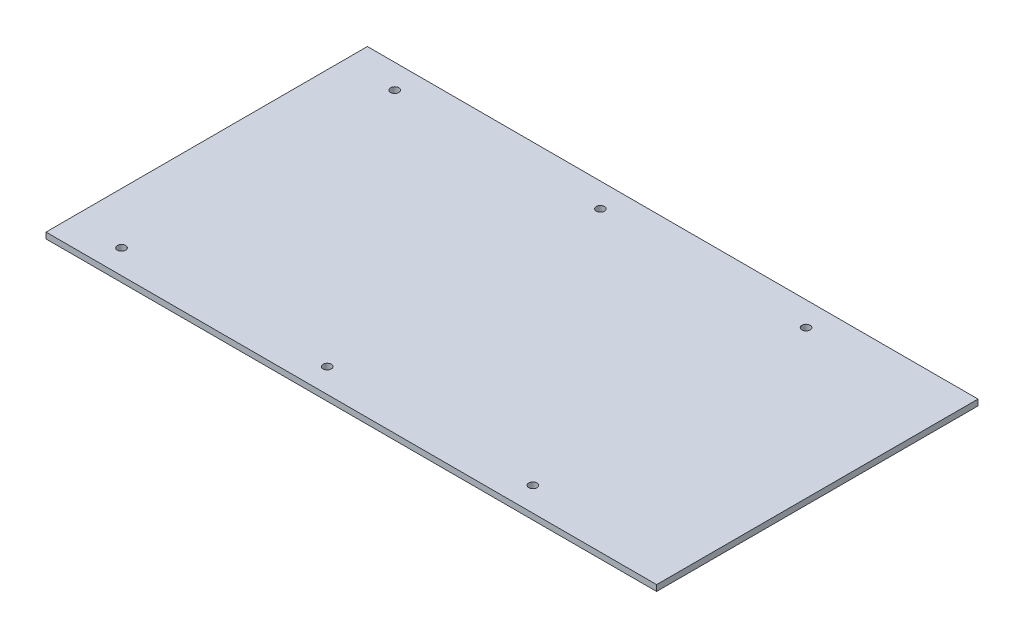
ISO-10303-21;
HEADER;
FILE_DESCRIPTION(('STEP AP214'),'2;1');
FILE_NAME('part.step','',(''),(''),'','','');
FILE_SCHEMA(('AUTOMOTIVE_DESIGN { 1 0 10303 214 1 1 1 1 }'));
ENDSEC;
DATA;
#1=APPLICATION_CONTEXT('core data for automotive mechanical design processes');
#2=APPLICATION_PROTOCOL_DEFINITION('international standard','automotive_design',2000,#1);
#3=PRODUCT_CONTEXT('',#1,'mechanical');
#4=PRODUCT('Part','Part','',(#3));
#5=PRODUCT_RELATED_PRODUCT_CATEGORY('part','',(#4));
#6=PRODUCT_DEFINITION_FORMATION('','',#4);
#7=PRODUCT_DEFINITION_CONTEXT('part definition',#1,'design');
#8=PRODUCT_DEFINITION('design','',#6,#7);
#9=PRODUCT_DEFINITION_SHAPE('','',#8);
#10=(LENGTH_UNIT() NAMED_UNIT(*) SI_UNIT(.MILLI.,.METRE.));
#11=(NAMED_UNIT(*) PLANE_ANGLE_UNIT() SI_UNIT($,.RADIAN.));
#12=(NAMED_UNIT(*) SI_UNIT($,.STERADIAN.) SOLID_ANGLE_UNIT());
#13=UNCERTAINTY_MEASURE_WITH_UNIT(LENGTH_MEASURE(1.E-05),#10,'distance_accuracy_value','');
#14=(GEOMETRIC_REPRESENTATION_CONTEXT(3) GLOBAL_UNCERTAINTY_ASSIGNED_CONTEXT((#13)) GLOBAL_UNIT_ASSIGNED_CONTEXT((#10,
#11,#12)) REPRESENTATION_CONTEXT('',''));
#15=CARTESIAN_POINT('',(0.,0.,0.));
#16=DIRECTION('',(0.,0.,1.));
#17=DIRECTION('',(1.,0.,0.));
#18=AXIS2_PLACEMENT_3D('',#15,#16,#17);
#19=CARTESIAN_POINT('',(-101.6,2.3622,-63.5));
#20=DIRECTION('',(1.,0.,0.));
#21=DIRECTION('',(0.,0.,-1.));
#22=AXIS2_PLACEMENT_3D('',#19,#20,#21);
#23=PLANE('',#22);
#24=DIRECTION('',(0.,0.,1.));
#25=VECTOR('',#24,1.);
#26=CARTESIAN_POINT('',(-101.6,0.,-63.5));
#27=LINE('',#26,#25);
#28=CARTESIAN_POINT('',(-101.6,0.,-63.5));
#29=VERTEX_POINT('',#28);
#30=CARTESIAN_POINT('',(-101.6,0.,63.5));
#31=VERTEX_POINT('',#30);
#32=EDGE_CURVE('E84',#29,#31,#27,.T.);
#33=ORIENTED_EDGE('',*,*,#32,.T.);
#34=DIRECTION('',(0.,-1.,0.));
#35=VECTOR('',#34,1.);
#36=CARTESIAN_POINT('',(-101.6,2.3622,63.5));
#37=LINE('',#36,#35);
#38=CARTESIAN_POINT('',(-101.6,2.3622,63.5));
#39=VERTEX_POINT('',#38);
#40=EDGE_CURVE('E11',#39,#31,#37,.T.);
#41=ORIENTED_EDGE('',*,*,#40,.F.);
#42=DIRECTION('',(0.,0.,1.));
#43=VECTOR('',#42,1.);
#44=CARTESIAN_POINT('',(-101.6,2.3622,-63.5));
#45=LINE('',#44,#43);
#46=CARTESIAN_POINT('',(-101.6,2.3622,-63.5));
#47=VERTEX_POINT('',#46);
#48=EDGE_CURVE('E127',#47,#39,#45,.T.);
#49=ORIENTED_EDGE('',*,*,#48,.F.);
#50=DIRECTION('',(0.,-1.,0.));
#51=VECTOR('',#50,1.);
#52=CARTESIAN_POINT('',(-101.6,2.3622,-63.5));
#53=LINE('',#52,#51);
#54=EDGE_CURVE('E42',#47,#29,#53,.T.);
#55=ORIENTED_EDGE('',*,*,#54,.T.);
#56=EDGE_LOOP('',(#33,#41,#49,#55));
#57=FACE_BOUND('',#56,.T.);
#58=ADVANCED_FACE('F34',(#57),#23,.F.);
#59=CARTESIAN_POINT('',(-101.6,2.3622,63.5));
#60=DIRECTION('',(0.,0.,-1.));
#61=DIRECTION('',(-1.,0.,0.));
#62=AXIS2_PLACEMENT_3D('',#59,#60,#61);
#63=PLANE('',#62);
#64=DIRECTION('',(1.,0.,0.));
#65=VECTOR('',#64,1.);
#66=CARTESIAN_POINT('',(-101.6,0.,63.5));
#67=LINE('',#66,#65);
#68=CARTESIAN_POINT('',(139.7,0.,63.5));
#69=VERTEX_POINT('',#68);
#70=EDGE_CURVE('E73',#31,#69,#67,.T.);
#71=ORIENTED_EDGE('',*,*,#70,.T.);
#72=DIRECTION('',(0.,-1.,0.));
#73=VECTOR('',#72,1.);
#74=CARTESIAN_POINT('',(139.7,2.3622,63.5));
#75=LINE('',#74,#73);
#76=CARTESIAN_POINT('',(139.7,2.3622,63.5));
#77=VERTEX_POINT('',#76);
#78=EDGE_CURVE('E76',#77,#69,#75,.T.);
#79=ORIENTED_EDGE('',*,*,#78,.F.);
#80=DIRECTION('',(1.,0.,0.));
#81=VECTOR('',#80,1.);
#82=CARTESIAN_POINT('',(-101.6,2.3622,63.5));
#83=LINE('',#82,#81);
#84=EDGE_CURVE('E57',#39,#77,#83,.T.);
#85=ORIENTED_EDGE('',*,*,#84,.F.);
#86=ORIENTED_EDGE('',*,*,#40,.T.);
#87=EDGE_LOOP('',(#71,#79,#85,#86));
#88=FACE_BOUND('',#87,.T.);
#89=ADVANCED_FACE('F75',(#88),#63,.F.);
#90=CARTESIAN_POINT('',(-101.6,2.3622,-63.5));
#91=DIRECTION('',(0.,0.,1.));
#92=DIRECTION('',(1.,0.,0.));
#93=AXIS2_PLACEMENT_3D('',#90,#91,#92);
#94=PLANE('',#93);
#95=DIRECTION('',(-1.,0.,0.));
#96=VECTOR('',#95,1.);
#97=CARTESIAN_POINT('',(-101.6,0.,-63.5));
#98=LINE('',#97,#96);
#99=CARTESIAN_POINT('',(139.7,0.,-63.5));
#100=VERTEX_POINT('',#99);
#101=EDGE_CURVE('E83',#100,#29,#98,.T.);
#102=ORIENTED_EDGE('',*,*,#101,.T.);
#103=ORIENTED_EDGE('',*,*,#54,.F.);
#104=DIRECTION('',(-1.,0.,0.));
#105=VECTOR('',#104,1.);
#106=CARTESIAN_POINT('',(-101.6,2.3622,-63.5));
#107=LINE('',#106,#105);
#108=CARTESIAN_POINT('',(139.7,2.3622,-63.5));
#109=VERTEX_POINT('',#108);
#110=EDGE_CURVE('E50',#109,#47,#107,.T.);
#111=ORIENTED_EDGE('',*,*,#110,.F.);
#112=DIRECTION('',(0.,-1.,0.));
#113=VECTOR('',#112,1.);
#114=CARTESIAN_POINT('',(139.7,2.3622,-63.5));
#115=LINE('',#114,#113);
#116=EDGE_CURVE('E94',#109,#100,#115,.T.);
#117=ORIENTED_EDGE('',*,*,#116,.T.);
#118=EDGE_LOOP('',(#102,#103,#111,#117));
#119=FACE_BOUND('',#118,.T.);
#120=ADVANCED_FACE('F163',(#119),#94,.F.);
#121=CARTESIAN_POINT('',(-101.6,2.3622,63.5));
#122=DIRECTION('',(0.,1.,0.));
#123=DIRECTION('',(0.,0.,1.));
#124=AXIS2_PLACEMENT_3D('',#121,#122,#123);
#125=PLANE('',#124);
#126=CARTESIAN_POINT('',(-81.28,2.3622,-53.975));
#127=DIRECTION('',(0.,1.,0.));
#128=DIRECTION('',(0.,0.,1.));
#129=AXIS2_PLACEMENT_3D('',#126,#127,#128);
#130=CIRCLE('',#129,1.63194999999999);
#131=CARTESIAN_POINT('',(-81.28,2.3622,-52.34305));
#132=VERTEX_POINT('',#131);
#133=EDGE_CURVE('E93',#132,#132,#130,.T.);
#134=ORIENTED_EDGE('',*,*,#133,.F.);
#135=EDGE_LOOP('',(#134));
#136=FACE_BOUND('',#135,.T.);
#137=CARTESIAN_POINT('',(0.,2.3622,-53.975));
#138=DIRECTION('',(0.,1.,0.));
#139=DIRECTION('',(0.,0.,1.));
#140=AXIS2_PLACEMENT_3D('',#137,#138,#139);
#141=CIRCLE('',#140,1.63195);
#142=CARTESIAN_POINT('',(0.,2.3622,-52.34305));
#143=VERTEX_POINT('',#142);
#144=EDGE_CURVE('E103',#143,#143,#141,.T.);
#145=ORIENTED_EDGE('',*,*,#144,.F.);
#146=EDGE_LOOP('',(#145));
#147=FACE_BOUND('',#146,.T.);
#148=CARTESIAN_POINT('',(0.,2.3622,53.975));
#149=DIRECTION('',(0.,1.,0.));
#150=DIRECTION('',(0.,0.,1.));
#151=AXIS2_PLACEMENT_3D('',#148,#149,#150);
#152=CIRCLE('',#151,1.63195);
#153=CARTESIAN_POINT('',(0.,2.3622,55.60695));
#154=VERTEX_POINT('',#153);
#155=EDGE_CURVE('E107',#154,#154,#152,.T.);
#156=ORIENTED_EDGE('',*,*,#155,.F.);
#157=EDGE_LOOP('',(#156));
#158=FACE_BOUND('',#157,.T.);
#159=CARTESIAN_POINT('',(-81.28,2.3622,53.975));
#160=DIRECTION('',(0.,1.,0.));
#161=DIRECTION('',(0.,0.,1.));
#162=AXIS2_PLACEMENT_3D('',#159,#160,#161);
#163=CIRCLE('',#162,1.63194999999999);
#164=CARTESIAN_POINT('',(-81.28,2.3622,55.60695));
#165=VERTEX_POINT('',#164);
#166=EDGE_CURVE('E111',#165,#165,#163,.T.);
#167=ORIENTED_EDGE('',*,*,#166,.F.);
#168=EDGE_LOOP('',(#167));
#169=FACE_BOUND('',#168,.T.);
#170=CARTESIAN_POINT('',(81.28,2.3622,53.975));
#171=DIRECTION('',(0.,1.,0.));
#172=DIRECTION('',(0.,0.,1.));
#173=AXIS2_PLACEMENT_3D('',#170,#171,#172);
#174=CIRCLE('',#173,1.63194999999999);
#175=CARTESIAN_POINT('',(81.28,2.3622,55.60695));
#176=VERTEX_POINT('',#175);
#177=EDGE_CURVE('E115',#176,#176,#174,.T.);
#178=ORIENTED_EDGE('',*,*,#177,.F.);
#179=EDGE_LOOP('',(#178));
#180=FACE_BOUND('',#179,.T.);
#181=CARTESIAN_POINT('',(81.28,2.3622,-53.975));
#182=DIRECTION('',(0.,1.,0.));
#183=DIRECTION('',(0.,0.,1.));
#184=AXIS2_PLACEMENT_3D('',#181,#182,#183);
#185=CIRCLE('',#184,1.63194999999999);
#186=CARTESIAN_POINT('',(81.28,2.3622,-52.34305));
#187=VERTEX_POINT('',#186);
#188=EDGE_CURVE('E119',#187,#187,#185,.T.);
#189=ORIENTED_EDGE('',*,*,#188,.F.);
#190=EDGE_LOOP('',(#189));
#191=FACE_BOUND('',#190,.T.);
#192=ORIENTED_EDGE('',*,*,#48,.T.);
#193=ORIENTED_EDGE('',*,*,#84,.T.);
#194=DIRECTION('',(0.,0.,-1.));
#195=VECTOR('',#194,1.);
#196=CARTESIAN_POINT('',(139.7,2.3622,-63.5));
#197=LINE('',#196,#195);
#198=EDGE_CURVE('E92',#77,#109,#197,.T.);
#199=ORIENTED_EDGE('',*,*,#198,.T.);
#200=ORIENTED_EDGE('',*,*,#110,.T.);
#201=EDGE_LOOP('',(#192,#193,#199,#200));
#202=FACE_BOUND('',#201,.T.);
#203=ADVANCED_FACE('F166',(#136,#147,#158,#169,#180,#191,#202),#125,.T.);
#204=CARTESIAN_POINT('',(-101.6,0.,63.5));
#205=DIRECTION('',(0.,1.,0.));
#206=DIRECTION('',(0.,0.,1.));
#207=AXIS2_PLACEMENT_3D('',#204,#205,#206);
#208=PLANE('',#207);
#209=CARTESIAN_POINT('',(-81.28,0.,-53.975));
#210=DIRECTION('',(0.,1.,0.));
#211=DIRECTION('',(0.,0.,1.));
#212=AXIS2_PLACEMENT_3D('',#209,#210,#211);
#213=CIRCLE('',#212,1.63194999999999);
#214=CARTESIAN_POINT('',(-81.28,0.,-52.34305));
#215=VERTEX_POINT('',#214);
#216=EDGE_CURVE('E37',#215,#215,#213,.T.);
#217=ORIENTED_EDGE('',*,*,#216,.T.);
#218=EDGE_LOOP('',(#217));
#219=FACE_BOUND('',#218,.T.);
#220=CARTESIAN_POINT('',(0.,0.,-53.975));
#221=DIRECTION('',(0.,1.,0.));
#222=DIRECTION('',(0.,0.,1.));
#223=AXIS2_PLACEMENT_3D('',#220,#221,#222);
#224=CIRCLE('',#223,1.63195);
#225=CARTESIAN_POINT('',(0.,0.,-52.34305));
#226=VERTEX_POINT('',#225);
#227=EDGE_CURVE('E106',#226,#226,#224,.T.);
#228=ORIENTED_EDGE('',*,*,#227,.T.);
#229=EDGE_LOOP('',(#228));
#230=FACE_BOUND('',#229,.T.);
#231=CARTESIAN_POINT('',(0.,0.,53.975));
#232=DIRECTION('',(0.,1.,0.));
#233=DIRECTION('',(0.,0.,1.));
#234=AXIS2_PLACEMENT_3D('',#231,#232,#233);
#235=CIRCLE('',#234,1.63195);
#236=CARTESIAN_POINT('',(0.,0.,55.60695));
#237=VERTEX_POINT('',#236);
#238=EDGE_CURVE('E110',#237,#237,#235,.T.);
#239=ORIENTED_EDGE('',*,*,#238,.T.);
#240=EDGE_LOOP('',(#239));
#241=FACE_BOUND('',#240,.T.);
#242=CARTESIAN_POINT('',(-81.28,0.,53.975));
#243=DIRECTION('',(0.,1.,0.));
#244=DIRECTION('',(0.,0.,1.));
#245=AXIS2_PLACEMENT_3D('',#242,#243,#244);
#246=CIRCLE('',#245,1.63194999999999);
#247=CARTESIAN_POINT('',(-81.28,0.,55.60695));
#248=VERTEX_POINT('',#247);
#249=EDGE_CURVE('E114',#248,#248,#246,.T.);
#250=ORIENTED_EDGE('',*,*,#249,.T.);
#251=EDGE_LOOP('',(#250));
#252=FACE_BOUND('',#251,.T.);
#253=CARTESIAN_POINT('',(81.28,0.,53.975));
#254=DIRECTION('',(0.,1.,0.));
#255=DIRECTION('',(0.,0.,1.));
#256=AXIS2_PLACEMENT_3D('',#253,#254,#255);
#257=CIRCLE('',#256,1.63194999999999);
#258=CARTESIAN_POINT('',(81.28,0.,55.60695));
#259=VERTEX_POINT('',#258);
#260=EDGE_CURVE('E118',#259,#259,#257,.T.);
#261=ORIENTED_EDGE('',*,*,#260,.T.);
#262=EDGE_LOOP('',(#261));
#263=FACE_BOUND('',#262,.T.);
#264=CARTESIAN_POINT('',(81.28,0.,-53.975));
#265=DIRECTION('',(0.,1.,0.));
#266=DIRECTION('',(0.,0.,1.));
#267=AXIS2_PLACEMENT_3D('',#264,#265,#266);
#268=CIRCLE('',#267,1.63194999999999);
#269=CARTESIAN_POINT('',(81.28,0.,-52.34305));
#270=VERTEX_POINT('',#269);
#271=EDGE_CURVE('E122',#270,#270,#268,.T.);
#272=ORIENTED_EDGE('',*,*,#271,.T.);
#273=EDGE_LOOP('',(#272));
#274=FACE_BOUND('',#273,.T.);
#275=ORIENTED_EDGE('',*,*,#32,.F.);
#276=ORIENTED_EDGE('',*,*,#101,.F.);
#277=DIRECTION('',(0.,0.,-1.));
#278=VECTOR('',#277,1.);
#279=CARTESIAN_POINT('',(139.7,0.,-63.5));
#280=LINE('',#279,#278);
#281=EDGE_CURVE('E90',#69,#100,#280,.T.);
#282=ORIENTED_EDGE('',*,*,#281,.F.);
#283=ORIENTED_EDGE('',*,*,#70,.F.);
#284=EDGE_LOOP('',(#275,#276,#282,#283));
#285=FACE_BOUND('',#284,.T.);
#286=ADVANCED_FACE('F96',(#219,#230,#241,#252,#263,#274,#285),#208,.F.);
#287=CARTESIAN_POINT('',(81.28,2.3622,-53.975));
#288=DIRECTION('',(0.,1.,0.));
#289=DIRECTION('',(0.,0.,1.));
#290=AXIS2_PLACEMENT_3D('',#287,#288,#289);
#291=CYLINDRICAL_SURFACE('',#290,1.63194999999999);
#292=ORIENTED_EDGE('',*,*,#188,.T.);
#293=EDGE_LOOP('',(#292));
#294=FACE_BOUND('',#293,.T.);
#295=ORIENTED_EDGE('',*,*,#271,.F.);
#296=EDGE_LOOP('',(#295));
#297=FACE_BOUND('',#296,.T.);
#298=ADVANCED_FACE('F174',(#294,#297),#291,.F.);
#299=CARTESIAN_POINT('',(81.28,2.3622,53.975));
#300=DIRECTION('',(0.,1.,0.));
#301=DIRECTION('',(0.,0.,1.));
#302=AXIS2_PLACEMENT_3D('',#299,#300,#301);
#303=CYLINDRICAL_SURFACE('',#302,1.63194999999999);
#304=ORIENTED_EDGE('',*,*,#177,.T.);
#305=EDGE_LOOP('',(#304));
#306=FACE_BOUND('',#305,.T.);
#307=ORIENTED_EDGE('',*,*,#260,.F.);
#308=EDGE_LOOP('',(#307));
#309=FACE_BOUND('',#308,.T.);
#310=ADVANCED_FACE('F183',(#306,#309),#303,.F.);
#311=CARTESIAN_POINT('',(-81.28,2.3622,53.975));
#312=DIRECTION('',(0.,1.,0.));
#313=DIRECTION('',(0.,0.,1.));
#314=AXIS2_PLACEMENT_3D('',#311,#312,#313);
#315=CYLINDRICAL_SURFACE('',#314,1.63194999999999);
#316=ORIENTED_EDGE('',*,*,#166,.T.);
#317=EDGE_LOOP('',(#316));
#318=FACE_BOUND('',#317,.T.);
#319=ORIENTED_EDGE('',*,*,#249,.F.);
#320=EDGE_LOOP('',(#319));
#321=FACE_BOUND('',#320,.T.);
#322=ADVANCED_FACE('F155',(#318,#321),#315,.F.);
#323=CARTESIAN_POINT('',(0.,2.3622,53.975));
#324=DIRECTION('',(0.,1.,0.));
#325=DIRECTION('',(0.,0.,1.));
#326=AXIS2_PLACEMENT_3D('',#323,#324,#325);
#327=CYLINDRICAL_SURFACE('',#326,1.63195);
#328=ORIENTED_EDGE('',*,*,#155,.T.);
#329=EDGE_LOOP('',(#328));
#330=FACE_BOUND('',#329,.T.);
#331=ORIENTED_EDGE('',*,*,#238,.F.);
#332=EDGE_LOOP('',(#331));
#333=FACE_BOUND('',#332,.T.);
#334=ADVANCED_FACE('F146',(#330,#333),#327,.F.);
#335=CARTESIAN_POINT('',(0.,2.3622,-53.975));
#336=DIRECTION('',(0.,1.,0.));
#337=DIRECTION('',(0.,0.,1.));
#338=AXIS2_PLACEMENT_3D('',#335,#336,#337);
#339=CYLINDRICAL_SURFACE('',#338,1.63195);
#340=ORIENTED_EDGE('',*,*,#144,.T.);
#341=EDGE_LOOP('',(#340));
#342=FACE_BOUND('',#341,.T.);
#343=ORIENTED_EDGE('',*,*,#227,.F.);
#344=EDGE_LOOP('',(#343));
#345=FACE_BOUND('',#344,.T.);
#346=ADVANCED_FACE('F143',(#342,#345),#339,.F.);
#347=CARTESIAN_POINT('',(-81.28,2.3622,-53.975));
#348=DIRECTION('',(0.,1.,0.));
#349=DIRECTION('',(0.,0.,1.));
#350=AXIS2_PLACEMENT_3D('',#347,#348,#349);
#351=CYLINDRICAL_SURFACE('',#350,1.63194999999999);
#352=ORIENTED_EDGE('',*,*,#133,.T.);
#353=EDGE_LOOP('',(#352));
#354=FACE_BOUND('',#353,.T.);
#355=ORIENTED_EDGE('',*,*,#216,.F.);
#356=EDGE_LOOP('',(#355));
#357=FACE_BOUND('',#356,.T.);
#358=ADVANCED_FACE('F145',(#354,#357),#351,.F.);
#359=CARTESIAN_POINT('',(139.7,2.3622,-63.5));
#360=DIRECTION('',(-1.,0.,0.));
#361=DIRECTION('',(0.,0.,1.));
#362=AXIS2_PLACEMENT_3D('',#359,#360,#361);
#363=PLANE('',#362);
#364=ORIENTED_EDGE('',*,*,#281,.T.);
#365=ORIENTED_EDGE('',*,*,#116,.F.);
#366=ORIENTED_EDGE('',*,*,#198,.F.);
#367=ORIENTED_EDGE('',*,*,#78,.T.);
#368=EDGE_LOOP('',(#364,#365,#366,#367));
#369=FACE_BOUND('',#368,.T.);
#370=ADVANCED_FACE('F88',(#369),#363,.F.);
#371=CLOSED_SHELL('',(#58,#89,#120,#203,#286,#298,#310,#322,#334,#346,#358,#370));
#372=MANIFOLD_SOLID_BREP('B2',#371);
#373=ADVANCED_BREP_SHAPE_REPRESENTATION('',(#18,#372),#14);
#374=SHAPE_DEFINITION_REPRESENTATION(#9,#373);
ENDSEC;
END-ISO-10303-21;
